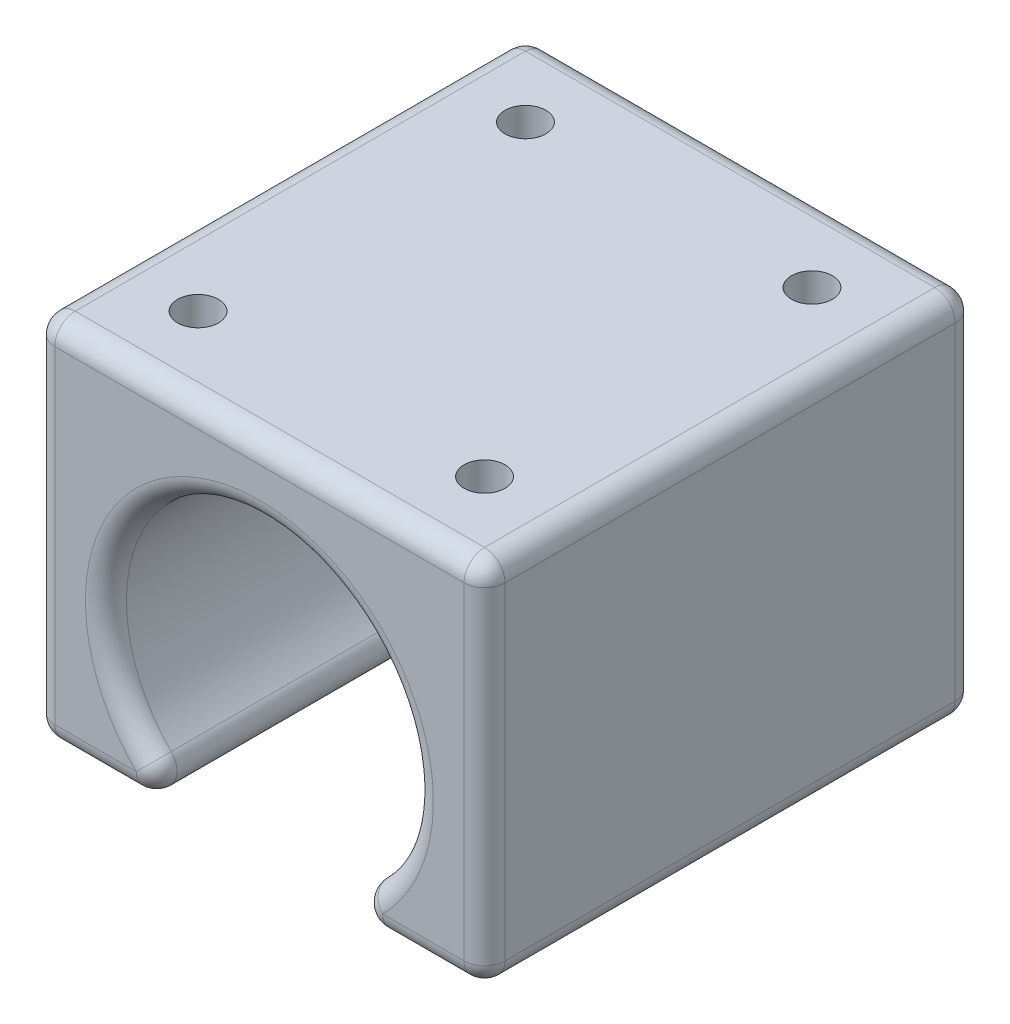
ISO-10303-21;
HEADER;
FILE_DESCRIPTION(('STEP AP214'),'2;1');
FILE_NAME('part.step','',(''),(''),'','','');
FILE_SCHEMA(('AUTOMOTIVE_DESIGN { 1 0 10303 214 1 1 1 1 }'));
ENDSEC;
DATA;
#1=APPLICATION_CONTEXT('core data for automotive mechanical design processes');
#2=APPLICATION_PROTOCOL_DEFINITION('international standard','automotive_design',2000,#1);
#3=PRODUCT_CONTEXT('',#1,'mechanical');
#4=PRODUCT('Part','Part','',(#3));
#5=PRODUCT_RELATED_PRODUCT_CATEGORY('part','',(#4));
#6=PRODUCT_DEFINITION_FORMATION('','',#4);
#7=PRODUCT_DEFINITION_CONTEXT('part definition',#1,'design');
#8=PRODUCT_DEFINITION('design','',#6,#7);
#9=PRODUCT_DEFINITION_SHAPE('','',#8);
#10=(LENGTH_UNIT() NAMED_UNIT(*) SI_UNIT(.MILLI.,.METRE.));
#11=(NAMED_UNIT(*) PLANE_ANGLE_UNIT() SI_UNIT($,.RADIAN.));
#12=(NAMED_UNIT(*) SI_UNIT($,.STERADIAN.) SOLID_ANGLE_UNIT());
#13=UNCERTAINTY_MEASURE_WITH_UNIT(LENGTH_MEASURE(1.E-05),#10,'distance_accuracy_value','');
#14=(GEOMETRIC_REPRESENTATION_CONTEXT(3) GLOBAL_UNCERTAINTY_ASSIGNED_CONTEXT((#13)) GLOBAL_UNIT_ASSIGNED_CONTEXT((#10,
#11,#12)) REPRESENTATION_CONTEXT('',''));
#15=CARTESIAN_POINT('',(0.,0.,0.));
#16=DIRECTION('',(0.,0.,1.));
#17=DIRECTION('',(1.,0.,0.));
#18=AXIS2_PLACEMENT_3D('',#15,#16,#17);
#19=CARTESIAN_POINT('',(-11.,-8.99999999999999,-12.));
#20=DIRECTION('',(-1.,0.,0.));
#21=DIRECTION('',(0.,0.,1.));
#22=AXIS2_PLACEMENT_3D('',#19,#20,#21);
#23=PLANE('',#22);
#24=DIRECTION('',(0.,0.,1.));
#25=VECTOR('',#24,1.);
#26=CARTESIAN_POINT('',(-11.,8.,-12.));
#27=LINE('',#26,#25);
#28=CARTESIAN_POINT('',(-11.,8.,11.));
#29=VERTEX_POINT('',#28);
#30=CARTESIAN_POINT('',(-11.,8.,-11.));
#31=VERTEX_POINT('',#30);
#32=EDGE_CURVE('E172',#29,#31,#27,.F.);
#33=ORIENTED_EDGE('',*,*,#32,.T.);
#34=DIRECTION('',(0.,-1.,0.));
#35=VECTOR('',#34,1.);
#36=CARTESIAN_POINT('',(-11.,-8.99999999999999,-11.));
#37=LINE('',#36,#35);
#38=CARTESIAN_POINT('',(-11.,-7.99999999999999,-11.));
#39=VERTEX_POINT('',#38);
#40=EDGE_CURVE('E211',#31,#39,#37,.T.);
#41=ORIENTED_EDGE('',*,*,#40,.T.);
#42=DIRECTION('',(0.,0.,1.));
#43=VECTOR('',#42,1.);
#44=CARTESIAN_POINT('',(-11.,-7.99999999999999,-12.));
#45=LINE('',#44,#43);
#46=CARTESIAN_POINT('',(-11.,-7.99999999999999,11.));
#47=VERTEX_POINT('',#46);
#48=EDGE_CURVE('E204',#39,#47,#45,.T.);
#49=ORIENTED_EDGE('',*,*,#48,.T.);
#50=DIRECTION('',(0.,-1.,0.));
#51=VECTOR('',#50,1.);
#52=CARTESIAN_POINT('',(-11.,-8.99999999999999,11.));
#53=LINE('',#52,#51);
#54=EDGE_CURVE('E202',#47,#29,#53,.F.);
#55=ORIENTED_EDGE('',*,*,#54,.T.);
#56=EDGE_LOOP('',(#33,#41,#49,#55));
#57=FACE_BOUND('',#56,.T.);
#58=ADVANCED_FACE('F40',(#57),#23,.T.);
#59=CARTESIAN_POINT('',(11.,9.,-12.));
#60=DIRECTION('',(0.,1.,0.));
#61=DIRECTION('',(0.,0.,1.));
#62=AXIS2_PLACEMENT_3D('',#59,#60,#61);
#63=PLANE('',#62);
#64=DIRECTION('',(-1.,0.,0.));
#65=VECTOR('',#64,1.);
#66=CARTESIAN_POINT('',(-11.,9.,-11.));
#67=LINE('',#66,#65);
#68=CARTESIAN_POINT('',(9.99999999999999,9.,-11.));
#69=VERTEX_POINT('',#68);
#70=CARTESIAN_POINT('',(-10.,9.,-11.));
#71=VERTEX_POINT('',#70);
#72=EDGE_CURVE('E200',#69,#71,#67,.T.);
#73=ORIENTED_EDGE('',*,*,#72,.T.);
#74=DIRECTION('',(0.,0.,1.));
#75=VECTOR('',#74,1.);
#76=CARTESIAN_POINT('',(-10.,9.,-12.));
#77=LINE('',#76,#75);
#78=CARTESIAN_POINT('',(-10.,9.,11.));
#79=VERTEX_POINT('',#78);
#80=EDGE_CURVE('E170',#71,#79,#77,.T.);
#81=ORIENTED_EDGE('',*,*,#80,.T.);
#82=DIRECTION('',(-1.,0.,0.));
#83=VECTOR('',#82,1.);
#84=CARTESIAN_POINT('',(11.,9.,11.));
#85=LINE('',#84,#83);
#86=CARTESIAN_POINT('',(9.99999999999999,9.,11.));
#87=VERTEX_POINT('',#86);
#88=EDGE_CURVE('E188',#79,#87,#85,.F.);
#89=ORIENTED_EDGE('',*,*,#88,.T.);
#90=DIRECTION('',(0.,0.,1.));
#91=VECTOR('',#90,1.);
#92=CARTESIAN_POINT('',(9.99999999999999,9.,-12.));
#93=LINE('',#92,#91);
#94=EDGE_CURVE('E194',#87,#69,#93,.F.);
#95=ORIENTED_EDGE('',*,*,#94,.T.);
#96=EDGE_LOOP('',(#73,#81,#89,#95));
#97=FACE_BOUND('',#96,.T.);
#98=CARTESIAN_POINT('',(-7.,9.,8.));
#99=DIRECTION('',(0.,1.,0.));
#100=DIRECTION('',(0.,0.,1.));
#101=AXIS2_PLACEMENT_3D('',#98,#99,#100);
#102=CIRCLE('',#101,1.);
#103=CARTESIAN_POINT('',(-7.,9.,9.));
#104=VERTEX_POINT('',#103);
#105=EDGE_CURVE('E368',#104,#104,#102,.T.);
#106=ORIENTED_EDGE('',*,*,#105,.F.);
#107=EDGE_LOOP('',(#106));
#108=FACE_BOUND('',#107,.T.);
#109=CARTESIAN_POINT('',(7.,9.,8.));
#110=DIRECTION('',(0.,1.,0.));
#111=DIRECTION('',(0.,0.,1.));
#112=AXIS2_PLACEMENT_3D('',#109,#110,#111);
#113=CIRCLE('',#112,1.);
#114=CARTESIAN_POINT('',(7.,9.,9.));
#115=VERTEX_POINT('',#114);
#116=EDGE_CURVE('E986',#115,#115,#113,.T.);
#117=ORIENTED_EDGE('',*,*,#116,.F.);
#118=EDGE_LOOP('',(#117));
#119=FACE_BOUND('',#118,.T.);
#120=CARTESIAN_POINT('',(7.,9.,-8.));
#121=DIRECTION('',(0.,1.,0.));
#122=DIRECTION('',(0.,0.,1.));
#123=AXIS2_PLACEMENT_3D('',#120,#121,#122);
#124=CIRCLE('',#123,1.);
#125=CARTESIAN_POINT('',(7.,9.,-7.));
#126=VERTEX_POINT('',#125);
#127=EDGE_CURVE('E381',#126,#126,#124,.T.);
#128=ORIENTED_EDGE('',*,*,#127,.F.);
#129=EDGE_LOOP('',(#128));
#130=FACE_BOUND('',#129,.T.);
#131=CARTESIAN_POINT('',(-7.,9.,-8.));
#132=DIRECTION('',(0.,1.,0.));
#133=DIRECTION('',(0.,0.,1.));
#134=AXIS2_PLACEMENT_3D('',#131,#132,#133);
#135=CIRCLE('',#134,1.);
#136=CARTESIAN_POINT('',(-7.,9.,-7.));
#137=VERTEX_POINT('',#136);
#138=EDGE_CURVE('E379',#137,#137,#135,.T.);
#139=ORIENTED_EDGE('',*,*,#138,.F.);
#140=EDGE_LOOP('',(#139));
#141=FACE_BOUND('',#140,.T.);
#142=ADVANCED_FACE('F197',(#97,#108,#119,#130,#141),#63,.T.);
#143=CARTESIAN_POINT('',(11.,-8.99999999999999,-12.));
#144=DIRECTION('',(1.,0.,0.));
#145=DIRECTION('',(0.,0.,-1.));
#146=AXIS2_PLACEMENT_3D('',#143,#144,#145);
#147=PLANE('',#146);
#148=DIRECTION('',(0.,0.,1.));
#149=VECTOR('',#148,1.);
#150=CARTESIAN_POINT('',(11.,-7.99999999999999,-12.));
#151=LINE('',#150,#149);
#152=CARTESIAN_POINT('',(11.,-7.99999999999999,11.));
#153=VERTEX_POINT('',#152);
#154=CARTESIAN_POINT('',(11.,-7.99999999999999,-11.));
#155=VERTEX_POINT('',#154);
#156=EDGE_CURVE('E257',#153,#155,#151,.F.);
#157=ORIENTED_EDGE('',*,*,#156,.T.);
#158=DIRECTION('',(0.,1.,0.));
#159=VECTOR('',#158,1.);
#160=CARTESIAN_POINT('',(11.,9.,-11.));
#161=LINE('',#160,#159);
#162=CARTESIAN_POINT('',(11.,8.,-11.));
#163=VERTEX_POINT('',#162);
#164=EDGE_CURVE('E259',#155,#163,#161,.T.);
#165=ORIENTED_EDGE('',*,*,#164,.T.);
#166=DIRECTION('',(0.,0.,1.));
#167=VECTOR('',#166,1.);
#168=CARTESIAN_POINT('',(11.,8.,-12.));
#169=LINE('',#168,#167);
#170=CARTESIAN_POINT('',(11.,8.,11.));
#171=VERTEX_POINT('',#170);
#172=EDGE_CURVE('E255',#163,#171,#169,.T.);
#173=ORIENTED_EDGE('',*,*,#172,.T.);
#174=DIRECTION('',(0.,1.,0.));
#175=VECTOR('',#174,1.);
#176=CARTESIAN_POINT('',(11.,-8.99999999999999,11.));
#177=LINE('',#176,#175);
#178=EDGE_CURVE('E253',#171,#153,#177,.F.);
#179=ORIENTED_EDGE('',*,*,#178,.T.);
#180=EDGE_LOOP('',(#157,#165,#173,#179));
#181=FACE_BOUND('',#180,.T.);
#182=ADVANCED_FACE('F430',(#181),#147,.T.);
#183=CARTESIAN_POINT('',(11.,-8.99999999999999,-12.));
#184=DIRECTION('',(0.,-1.,0.));
#185=DIRECTION('',(1.,0.,0.));
#186=AXIS2_PLACEMENT_3D('',#183,#184,#185);
#187=PLANE('',#186);
#188=DIRECTION('',(0.,0.,1.));
#189=VECTOR('',#188,1.);
#190=CARTESIAN_POINT('',(6.02079728939616,-8.99999999999999,-12.));
#191=LINE('',#190,#189);
#192=CARTESIAN_POINT('',(6.02079728939616,-8.99999999999999,11.));
#193=VERTEX_POINT('',#192);
#194=CARTESIAN_POINT('',(6.02079728939616,-8.99999999999999,-11.));
#195=VERTEX_POINT('',#194);
#196=EDGE_CURVE('E244',#193,#195,#191,.F.);
#197=ORIENTED_EDGE('',*,*,#196,.T.);
#198=DIRECTION('',(1.,0.,0.));
#199=VECTOR('',#198,1.);
#200=CARTESIAN_POINT('',(11.,-8.99999999999999,-11.));
#201=LINE('',#200,#199);
#202=CARTESIAN_POINT('',(9.99999999999999,-8.99999999999999,-11.));
#203=VERTEX_POINT('',#202);
#204=EDGE_CURVE('E250',#195,#203,#201,.T.);
#205=ORIENTED_EDGE('',*,*,#204,.T.);
#206=DIRECTION('',(0.,0.,1.));
#207=VECTOR('',#206,1.);
#208=CARTESIAN_POINT('',(9.99999999999999,-8.99999999999999,-12.));
#209=LINE('',#208,#207);
#210=CARTESIAN_POINT('',(9.99999999999999,-8.99999999999999,11.));
#211=VERTEX_POINT('',#210);
#212=EDGE_CURVE('E248',#203,#211,#209,.T.);
#213=ORIENTED_EDGE('',*,*,#212,.T.);
#214=DIRECTION('',(1.,0.,0.));
#215=VECTOR('',#214,1.);
#216=CARTESIAN_POINT('',(11.,-8.99999999999999,11.));
#217=LINE('',#216,#215);
#218=EDGE_CURVE('E246',#211,#193,#217,.F.);
#219=ORIENTED_EDGE('',*,*,#218,.T.);
#220=EDGE_LOOP('',(#197,#205,#213,#219));
#221=FACE_BOUND('',#220,.T.);
#222=ADVANCED_FACE('F540',(#221),#187,.T.);
#223=CARTESIAN_POINT('',(0.,-2.,-12.));
#224=DIRECTION('',(0.,0.,1.));
#225=DIRECTION('',(1.,0.,0.));
#226=AXIS2_PLACEMENT_3D('',#223,#224,#225);
#227=CYLINDRICAL_SURFACE('',#226,7.5);
#228=CARTESIAN_POINT('',(0.,-2.,-11.));
#229=DIRECTION('',(0.,0.,1.));
#230=DIRECTION('',(1.,0.,0.));
#231=AXIS2_PLACEMENT_3D('',#228,#229,#230);
#232=CIRCLE('',#231,7.5);
#233=CARTESIAN_POINT('',(-5.31246819652601,-7.29411764705882,-11.));
#234=VERTEX_POINT('',#233);
#235=CARTESIAN_POINT('',(5.31246819652602,-7.29411764705882,-11.));
#236=VERTEX_POINT('',#235);
#237=EDGE_CURVE('E239',#234,#236,#232,.F.);
#238=ORIENTED_EDGE('',*,*,#237,.T.);
#239=DIRECTION('',(0.,0.,1.));
#240=VECTOR('',#239,1.);
#241=CARTESIAN_POINT('',(5.31246819652602,-7.29411764705882,-12.));
#242=LINE('',#241,#240);
#243=CARTESIAN_POINT('',(5.31246819652602,-7.29411764705882,11.));
#244=VERTEX_POINT('',#243);
#245=EDGE_CURVE('E242',#236,#244,#242,.T.);
#246=ORIENTED_EDGE('',*,*,#245,.T.);
#247=CARTESIAN_POINT('',(0.,-2.,11.));
#248=DIRECTION('',(0.,0.,1.));
#249=DIRECTION('',(1.,0.,0.));
#250=AXIS2_PLACEMENT_3D('',#247,#248,#249);
#251=CIRCLE('',#250,7.5);
#252=CARTESIAN_POINT('',(-5.31246819652601,-7.29411764705882,11.));
#253=VERTEX_POINT('',#252);
#254=EDGE_CURVE('E237',#244,#253,#251,.T.);
#255=ORIENTED_EDGE('',*,*,#254,.T.);
#256=DIRECTION('',(0.,0.,1.));
#257=VECTOR('',#256,1.);
#258=CARTESIAN_POINT('',(-5.31246819652601,-7.29411764705882,-12.));
#259=LINE('',#258,#257);
#260=EDGE_CURVE('E235',#253,#234,#259,.F.);
#261=ORIENTED_EDGE('',*,*,#260,.T.);
#262=EDGE_LOOP('',(#238,#246,#255,#261));
#263=FACE_BOUND('',#262,.T.);
#264=ADVANCED_FACE('F545',(#263),#227,.F.);
#265=CARTESIAN_POINT('',(-2.69258240356727,-9.,-12.));
#266=DIRECTION('',(0.,-1.,0.));
#267=DIRECTION('',(1.,0.,0.));
#268=AXIS2_PLACEMENT_3D('',#265,#266,#267);
#269=PLANE('',#268);
#270=DIRECTION('',(1.,0.,0.));
#271=VECTOR('',#270,1.);
#272=CARTESIAN_POINT('',(-2.69258240356727,-9.,11.));
#273=LINE('',#272,#271);
#274=CARTESIAN_POINT('',(-6.02079728939615,-9.,11.));
#275=VERTEX_POINT('',#274);
#276=CARTESIAN_POINT('',(-10.,-8.99999999999999,11.));
#277=VERTEX_POINT('',#276);
#278=EDGE_CURVE('E215',#275,#277,#273,.F.);
#279=ORIENTED_EDGE('',*,*,#278,.T.);
#280=DIRECTION('',(0.,0.,1.));
#281=VECTOR('',#280,1.);
#282=CARTESIAN_POINT('',(-10.,-8.99999999999999,-12.));
#283=LINE('',#282,#281);
#284=CARTESIAN_POINT('',(-10.,-8.99999999999999,-11.));
#285=VERTEX_POINT('',#284);
#286=EDGE_CURVE('E219',#277,#285,#283,.F.);
#287=ORIENTED_EDGE('',*,*,#286,.T.);
#288=DIRECTION('',(1.,0.,0.));
#289=VECTOR('',#288,1.);
#290=CARTESIAN_POINT('',(-2.69258240356727,-9.,-11.));
#291=LINE('',#290,#289);
#292=CARTESIAN_POINT('',(-6.02079728939615,-9.,-11.));
#293=VERTEX_POINT('',#292);
#294=EDGE_CURVE('E217',#285,#293,#291,.T.);
#295=ORIENTED_EDGE('',*,*,#294,.T.);
#296=DIRECTION('',(0.,0.,1.));
#297=VECTOR('',#296,1.);
#298=CARTESIAN_POINT('',(-6.02079728939615,-9.,-12.));
#299=LINE('',#298,#297);
#300=EDGE_CURVE('E213',#293,#275,#299,.T.);
#301=ORIENTED_EDGE('',*,*,#300,.T.);
#302=EDGE_LOOP('',(#279,#287,#295,#301));
#303=FACE_BOUND('',#302,.T.);
#304=ADVANCED_FACE('F422',(#303),#269,.T.);
#305=CARTESIAN_POINT('',(0.,-2.,-12.));
#306=DIRECTION('',(0.,0.,1.));
#307=DIRECTION('',(1.,0.,0.));
#308=AXIS2_PLACEMENT_3D('',#305,#306,#307);
#309=PLANE('',#308);
#310=DIRECTION('',(1.,0.,0.));
#311=VECTOR('',#310,1.);
#312=CARTESIAN_POINT('',(-11.,-7.99999999999999,-12.));
#313=LINE('',#312,#311);
#314=CARTESIAN_POINT('',(-6.02079728939615,-8.,-12.));
#315=VERTEX_POINT('',#314);
#316=CARTESIAN_POINT('',(-10.,-7.99999999999999,-12.));
#317=VERTEX_POINT('',#316);
#318=EDGE_CURVE('E230',#315,#317,#313,.F.);
#319=ORIENTED_EDGE('',*,*,#318,.T.);
#320=DIRECTION('',(0.,-1.,0.));
#321=VECTOR('',#320,1.);
#322=CARTESIAN_POINT('',(-10.,9.,-12.));
#323=LINE('',#322,#321);
#324=CARTESIAN_POINT('',(-10.,8.,-12.));
#325=VERTEX_POINT('',#324);
#326=EDGE_CURVE('E233',#317,#325,#323,.F.);
#327=ORIENTED_EDGE('',*,*,#326,.T.);
#328=DIRECTION('',(-1.,0.,0.));
#329=VECTOR('',#328,1.);
#330=CARTESIAN_POINT('',(11.,8.,-12.));
#331=LINE('',#330,#329);
#332=CARTESIAN_POINT('',(9.99999999999999,8.,-12.));
#333=VERTEX_POINT('',#332);
#334=EDGE_CURVE('E224',#325,#333,#331,.F.);
#335=ORIENTED_EDGE('',*,*,#334,.T.);
#336=DIRECTION('',(0.,1.,0.));
#337=VECTOR('',#336,1.);
#338=CARTESIAN_POINT('',(9.99999999999999,-8.99999999999999,-12.));
#339=LINE('',#338,#337);
#340=CARTESIAN_POINT('',(9.99999999999999,-7.99999999999999,-12.));
#341=VERTEX_POINT('',#340);
#342=EDGE_CURVE('E222',#333,#341,#339,.F.);
#343=ORIENTED_EDGE('',*,*,#342,.T.);
#344=DIRECTION('',(1.,0.,0.));
#345=VECTOR('',#344,1.);
#346=CARTESIAN_POINT('',(2.69258240356727,-7.99999999999999,-12.));
#347=LINE('',#346,#345);
#348=CARTESIAN_POINT('',(6.02079728939616,-7.99999999999999,-12.));
#349=VERTEX_POINT('',#348);
#350=EDGE_CURVE('E226',#341,#349,#347,.F.);
#351=ORIENTED_EDGE('',*,*,#350,.T.);
#352=CARTESIAN_POINT('',(0.,-2.,-12.));
#353=DIRECTION('',(0.,0.,1.));
#354=DIRECTION('',(1.,0.,0.));
#355=AXIS2_PLACEMENT_3D('',#352,#353,#354);
#356=CIRCLE('',#355,8.5);
#357=EDGE_CURVE('E228',#349,#315,#356,.T.);
#358=ORIENTED_EDGE('',*,*,#357,.T.);
#359=EDGE_LOOP('',(#319,#327,#335,#343,#351,#358));
#360=FACE_BOUND('',#359,.T.);
#361=ADVANCED_FACE('F413',(#360),#309,.F.);
#362=CARTESIAN_POINT('',(0.,-2.,12.));
#363=DIRECTION('',(0.,0.,1.));
#364=DIRECTION('',(1.,0.,0.));
#365=AXIS2_PLACEMENT_3D('',#362,#363,#364);
#366=PLANE('',#365);
#367=DIRECTION('',(0.,1.,0.));
#368=VECTOR('',#367,1.);
#369=CARTESIAN_POINT('',(9.99999999999999,-2.,12.));
#370=LINE('',#369,#368);
#371=CARTESIAN_POINT('',(9.99999999999999,-7.99999999999999,12.));
#372=VERTEX_POINT('',#371);
#373=CARTESIAN_POINT('',(9.99999999999999,8.,12.));
#374=VERTEX_POINT('',#373);
#375=EDGE_CURVE('E49',#372,#374,#370,.T.);
#376=ORIENTED_EDGE('',*,*,#375,.T.);
#377=DIRECTION('',(-1.,0.,0.));
#378=VECTOR('',#377,1.);
#379=CARTESIAN_POINT('',(0.,8.,12.));
#380=LINE('',#379,#378);
#381=CARTESIAN_POINT('',(-10.,8.,12.));
#382=VERTEX_POINT('',#381);
#383=EDGE_CURVE('E11',#374,#382,#380,.T.);
#384=ORIENTED_EDGE('',*,*,#383,.T.);
#385=DIRECTION('',(0.,-1.,0.));
#386=VECTOR('',#385,1.);
#387=CARTESIAN_POINT('',(-10.,-2.,12.));
#388=LINE('',#387,#386);
#389=CARTESIAN_POINT('',(-10.,-8.,12.));
#390=VERTEX_POINT('',#389);
#391=EDGE_CURVE('E262',#382,#390,#388,.T.);
#392=ORIENTED_EDGE('',*,*,#391,.T.);
#393=DIRECTION('',(1.,0.,0.));
#394=VECTOR('',#393,1.);
#395=CARTESIAN_POINT('',(0.,-8.,12.));
#396=LINE('',#395,#394);
#397=CARTESIAN_POINT('',(-6.02079728939615,-8.,12.));
#398=VERTEX_POINT('',#397);
#399=EDGE_CURVE('E264',#390,#398,#396,.T.);
#400=ORIENTED_EDGE('',*,*,#399,.T.);
#401=CARTESIAN_POINT('',(0.,-2.,12.));
#402=DIRECTION('',(0.,0.,1.));
#403=DIRECTION('',(1.,0.,0.));
#404=AXIS2_PLACEMENT_3D('',#401,#402,#403);
#405=CIRCLE('',#404,8.5);
#406=CARTESIAN_POINT('',(6.02079728939616,-7.99999999999999,12.));
#407=VERTEX_POINT('',#406);
#408=EDGE_CURVE('E266',#398,#407,#405,.F.);
#409=ORIENTED_EDGE('',*,*,#408,.T.);
#410=DIRECTION('',(1.,0.,0.));
#411=VECTOR('',#410,1.);
#412=CARTESIAN_POINT('',(0.,-7.99999999999999,12.));
#413=LINE('',#412,#411);
#414=EDGE_CURVE('E60',#407,#372,#413,.T.);
#415=ORIENTED_EDGE('',*,*,#414,.T.);
#416=EDGE_LOOP('',(#376,#384,#392,#400,#409,#415));
#417=FACE_BOUND('',#416,.T.);
#418=ADVANCED_FACE('F410',(#417),#366,.T.);
#419=CARTESIAN_POINT('',(-7.,5.,-8.));
#420=DIRECTION('',(0.,1.,0.));
#421=DIRECTION('',(0.,0.,1.));
#422=AXIS2_PLACEMENT_3D('',#419,#420,#421);
#423=CYLINDRICAL_SURFACE('',#422,1.);
#424=CARTESIAN_POINT('',(-7.,5.,-8.));
#425=DIRECTION('',(0.,1.,0.));
#426=DIRECTION('',(0.,0.,1.));
#427=AXIS2_PLACEMENT_3D('',#424,#425,#426);
#428=CIRCLE('',#427,1.);
#429=CARTESIAN_POINT('',(-7.,5.,-7.));
#430=VERTEX_POINT('',#429);
#431=EDGE_CURVE('E195',#430,#430,#428,.T.);
#432=ORIENTED_EDGE('',*,*,#431,.F.);
#433=EDGE_LOOP('',(#432));
#434=FACE_BOUND('',#433,.T.);
#435=ORIENTED_EDGE('',*,*,#138,.T.);
#436=EDGE_LOOP('',(#435));
#437=FACE_BOUND('',#436,.T.);
#438=ADVANCED_FACE('F412',(#434,#437),#423,.F.);
#439=CARTESIAN_POINT('',(-7.,5.,-8.));
#440=DIRECTION('',(0.,1.,0.));
#441=DIRECTION('',(0.,0.,1.));
#442=AXIS2_PLACEMENT_3D('',#439,#440,#441);
#443=PLANE('',#442);
#444=ORIENTED_EDGE('',*,*,#431,.T.);
#445=EDGE_LOOP('',(#444));
#446=FACE_BOUND('',#445,.T.);
#447=ADVANCED_FACE('F419',(#446),#443,.T.);
#448=CARTESIAN_POINT('',(7.,5.,-8.));
#449=DIRECTION('',(0.,1.,0.));
#450=DIRECTION('',(0.,0.,1.));
#451=AXIS2_PLACEMENT_3D('',#448,#449,#450);
#452=CYLINDRICAL_SURFACE('',#451,1.);
#453=CARTESIAN_POINT('',(7.,5.,-8.));
#454=DIRECTION('',(0.,1.,0.));
#455=DIRECTION('',(0.,0.,1.));
#456=AXIS2_PLACEMENT_3D('',#453,#454,#455);
#457=CIRCLE('',#456,1.);
#458=CARTESIAN_POINT('',(7.,5.,-7.));
#459=VERTEX_POINT('',#458);
#460=EDGE_CURVE('E981',#459,#459,#457,.T.);
#461=ORIENTED_EDGE('',*,*,#460,.F.);
#462=EDGE_LOOP('',(#461));
#463=FACE_BOUND('',#462,.T.);
#464=ORIENTED_EDGE('',*,*,#127,.T.);
#465=EDGE_LOOP('',(#464));
#466=FACE_BOUND('',#465,.T.);
#467=ADVANCED_FACE('F909',(#463,#466),#452,.F.);
#468=CARTESIAN_POINT('',(7.,5.,-8.));
#469=DIRECTION('',(0.,1.,0.));
#470=DIRECTION('',(0.,0.,1.));
#471=AXIS2_PLACEMENT_3D('',#468,#469,#470);
#472=PLANE('',#471);
#473=ORIENTED_EDGE('',*,*,#460,.T.);
#474=EDGE_LOOP('',(#473));
#475=FACE_BOUND('',#474,.T.);
#476=ADVANCED_FACE('F899',(#475),#472,.T.);
#477=CARTESIAN_POINT('',(7.,5.,8.));
#478=DIRECTION('',(0.,1.,0.));
#479=DIRECTION('',(0.,0.,1.));
#480=AXIS2_PLACEMENT_3D('',#477,#478,#479);
#481=CYLINDRICAL_SURFACE('',#480,1.);
#482=CARTESIAN_POINT('',(7.,5.,8.));
#483=DIRECTION('',(0.,1.,0.));
#484=DIRECTION('',(0.,0.,1.));
#485=AXIS2_PLACEMENT_3D('',#482,#483,#484);
#486=CIRCLE('',#485,1.);
#487=CARTESIAN_POINT('',(7.,5.,9.));
#488=VERTEX_POINT('',#487);
#489=EDGE_CURVE('E373',#488,#488,#486,.T.);
#490=ORIENTED_EDGE('',*,*,#489,.F.);
#491=EDGE_LOOP('',(#490));
#492=FACE_BOUND('',#491,.T.);
#493=ORIENTED_EDGE('',*,*,#116,.T.);
#494=EDGE_LOOP('',(#493));
#495=FACE_BOUND('',#494,.T.);
#496=ADVANCED_FACE('F889',(#492,#495),#481,.F.);
#497=CARTESIAN_POINT('',(7.,5.,8.));
#498=DIRECTION('',(0.,1.,0.));
#499=DIRECTION('',(0.,0.,1.));
#500=AXIS2_PLACEMENT_3D('',#497,#498,#499);
#501=PLANE('',#500);
#502=ORIENTED_EDGE('',*,*,#489,.T.);
#503=EDGE_LOOP('',(#502));
#504=FACE_BOUND('',#503,.T.);
#505=ADVANCED_FACE('F879',(#504),#501,.T.);
#506=CARTESIAN_POINT('',(-7.,5.,8.));
#507=DIRECTION('',(0.,1.,0.));
#508=DIRECTION('',(0.,0.,1.));
#509=AXIS2_PLACEMENT_3D('',#506,#507,#508);
#510=CYLINDRICAL_SURFACE('',#509,1.);
#511=CARTESIAN_POINT('',(-7.,5.,8.));
#512=DIRECTION('',(0.,1.,0.));
#513=DIRECTION('',(0.,0.,1.));
#514=AXIS2_PLACEMENT_3D('',#511,#512,#513);
#515=CIRCLE('',#514,1.);
#516=CARTESIAN_POINT('',(-7.,5.,9.));
#517=VERTEX_POINT('',#516);
#518=EDGE_CURVE('E361',#517,#517,#515,.T.);
#519=ORIENTED_EDGE('',*,*,#518,.F.);
#520=EDGE_LOOP('',(#519));
#521=FACE_BOUND('',#520,.T.);
#522=ORIENTED_EDGE('',*,*,#105,.T.);
#523=EDGE_LOOP('',(#522));
#524=FACE_BOUND('',#523,.T.);
#525=ADVANCED_FACE('F870',(#521,#524),#510,.F.);
#526=CARTESIAN_POINT('',(-7.,5.,8.));
#527=DIRECTION('',(0.,1.,0.));
#528=DIRECTION('',(0.,0.,1.));
#529=AXIS2_PLACEMENT_3D('',#526,#527,#528);
#530=PLANE('',#529);
#531=ORIENTED_EDGE('',*,*,#518,.T.);
#532=EDGE_LOOP('',(#531));
#533=FACE_BOUND('',#532,.T.);
#534=ADVANCED_FACE('F532',(#533),#530,.T.);
#535=CARTESIAN_POINT('',(6.02079728939616,-7.99999999999999,-12.));
#536=DIRECTION('',(0.,0.,1.));
#537=DIRECTION('',(1.,0.,0.));
#538=AXIS2_PLACEMENT_3D('',#535,#536,#537);
#539=CYLINDRICAL_SURFACE('',#538,1.);
#540=CARTESIAN_POINT('',(6.02079728939616,-7.99999999999999,-11.));
#541=DIRECTION('',(0.,0.,-1.));
#542=DIRECTION('',(-1.,0.,0.));
#543=AXIS2_PLACEMENT_3D('',#540,#541,#542);
#544=CIRCLE('',#543,1.);
#545=EDGE_CURVE('E44',#195,#236,#544,.T.);
#546=ORIENTED_EDGE('',*,*,#545,.F.);
#547=ORIENTED_EDGE('',*,*,#196,.F.);
#548=CARTESIAN_POINT('',(6.02079728939616,-7.99999999999999,11.));
#549=DIRECTION('',(0.,0.,1.));
#550=DIRECTION('',(1.,0.,0.));
#551=AXIS2_PLACEMENT_3D('',#548,#549,#550);
#552=CIRCLE('',#551,1.);
#553=EDGE_CURVE('E354',#244,#193,#552,.T.);
#554=ORIENTED_EDGE('',*,*,#553,.F.);
#555=ORIENTED_EDGE('',*,*,#245,.F.);
#556=EDGE_LOOP('',(#546,#547,#554,#555));
#557=FACE_BOUND('',#556,.T.);
#558=ADVANCED_FACE('F42',(#557),#539,.T.);
#559=CARTESIAN_POINT('',(6.02079728939616,-7.99999999999999,-11.));
#560=DIRECTION('',(0.,0.,-1.));
#561=DIRECTION('',(0.,1.,0.));
#562=AXIS2_PLACEMENT_3D('',#559,#560,#561);
#563=SPHERICAL_SURFACE('',#562,1.);
#564=CARTESIAN_POINT('',(6.02079728939616,-7.99999999999999,-11.));
#565=DIRECTION('',(-1.,0.,0.));
#566=DIRECTION('',(0.,0.,1.));
#567=AXIS2_PLACEMENT_3D('',#564,#565,#566);
#568=CIRCLE('',#567,1.);
#569=EDGE_CURVE('E350',#195,#349,#568,.F.);
#570=ORIENTED_EDGE('',*,*,#569,.F.);
#571=ORIENTED_EDGE('',*,*,#545,.T.);
#572=CARTESIAN_POINT('',(6.02079728939616,-7.99999999999999,-11.));
#573=DIRECTION('',(-0.705882352941175,-0.708329092870136,0.));
#574=DIRECTION('',(0.708329092870136,-0.705882352941175,0.));
#575=AXIS2_PLACEMENT_3D('',#572,#573,#574);
#576=CIRCLE('',#575,1.);
#577=EDGE_CURVE('E353',#349,#236,#576,.F.);
#578=ORIENTED_EDGE('',*,*,#577,.F.);
#579=EDGE_LOOP('',(#570,#571,#578));
#580=FACE_BOUND('',#579,.T.);
#581=ADVANCED_FACE('F527',(#580),#563,.T.);
#582=CARTESIAN_POINT('',(6.02079728939616,-7.99999999999999,11.));
#583=DIRECTION('',(0.,0.,1.));
#584=DIRECTION('',(1.,0.,0.));
#585=AXIS2_PLACEMENT_3D('',#582,#583,#584);
#586=SPHERICAL_SURFACE('',#585,1.);
#587=CARTESIAN_POINT('',(6.02079728939616,-7.99999999999999,11.));
#588=DIRECTION('',(-0.705882352941175,-0.708329092870137,0.));
#589=DIRECTION('',(0.708329092870137,-0.705882352941175,0.));
#590=AXIS2_PLACEMENT_3D('',#587,#588,#589);
#591=CIRCLE('',#590,1.);
#592=EDGE_CURVE('E344',#244,#407,#591,.F.);
#593=ORIENTED_EDGE('',*,*,#592,.F.);
#594=ORIENTED_EDGE('',*,*,#553,.T.);
#595=CARTESIAN_POINT('',(6.02079728939616,-7.99999999999999,11.));
#596=DIRECTION('',(-1.,0.,0.));
#597=DIRECTION('',(0.,0.,1.));
#598=AXIS2_PLACEMENT_3D('',#595,#596,#597);
#599=CIRCLE('',#598,1.);
#600=EDGE_CURVE('E347',#407,#193,#599,.F.);
#601=ORIENTED_EDGE('',*,*,#600,.F.);
#602=EDGE_LOOP('',(#593,#594,#601));
#603=FACE_BOUND('',#602,.T.);
#604=ADVANCED_FACE('F524',(#603),#586,.T.);
#605=CARTESIAN_POINT('',(0.,-2.,-11.));
#606=DIRECTION('',(0.,0.,1.));
#607=DIRECTION('',(1.,0.,0.));
#608=AXIS2_PLACEMENT_3D('',#605,#606,#607);
#609=TOROIDAL_SURFACE('',#608,8.5,1.);
#610=ORIENTED_EDGE('',*,*,#577,.T.);
#611=ORIENTED_EDGE('',*,*,#237,.F.);
#612=CARTESIAN_POINT('',(-6.02079728939615,-8.,-11.));
#613=DIRECTION('',(0.705882352941175,-0.708329092870136,0.));
#614=DIRECTION('',(0.708329092870136,0.705882352941175,0.));
#615=AXIS2_PLACEMENT_3D('',#612,#613,#614);
#616=CIRCLE('',#615,1.);
#617=EDGE_CURVE('E338',#315,#234,#616,.T.);
#618=ORIENTED_EDGE('',*,*,#617,.F.);
#619=ORIENTED_EDGE('',*,*,#357,.F.);
#620=EDGE_LOOP('',(#610,#611,#618,#619));
#621=FACE_BOUND('',#620,.T.);
#622=ADVANCED_FACE('F520',(#621),#609,.T.);
#623=CARTESIAN_POINT('',(11.,-7.99999999999999,-11.));
#624=DIRECTION('',(-1.,0.,0.));
#625=DIRECTION('',(0.,-1.,0.));
#626=AXIS2_PLACEMENT_3D('',#623,#624,#625);
#627=CYLINDRICAL_SURFACE('',#626,1.);
#628=ORIENTED_EDGE('',*,*,#569,.T.);
#629=ORIENTED_EDGE('',*,*,#350,.F.);
#630=CARTESIAN_POINT('',(9.99999999999999,-7.99999999999999,-11.));
#631=DIRECTION('',(1.,0.,0.));
#632=DIRECTION('',(0.,0.,-1.));
#633=AXIS2_PLACEMENT_3D('',#630,#631,#632);
#634=CIRCLE('',#633,1.);
#635=EDGE_CURVE('E335',#203,#341,#634,.T.);
#636=ORIENTED_EDGE('',*,*,#635,.F.);
#637=ORIENTED_EDGE('',*,*,#204,.F.);
#638=EDGE_LOOP('',(#628,#629,#636,#637));
#639=FACE_BOUND('',#638,.T.);
#640=ADVANCED_FACE('F516',(#639),#627,.T.);
#641=CARTESIAN_POINT('',(9.99999999999999,-7.99999999999999,-12.));
#642=DIRECTION('',(0.,0.,1.));
#643=DIRECTION('',(1.,0.,0.));
#644=AXIS2_PLACEMENT_3D('',#641,#642,#643);
#645=CYLINDRICAL_SURFACE('',#644,1.);
#646=CARTESIAN_POINT('',(9.99999999999999,-7.99999999999999,11.));
#647=DIRECTION('',(0.,0.,1.));
#648=DIRECTION('',(1.,0.,0.));
#649=AXIS2_PLACEMENT_3D('',#646,#647,#648);
#650=CIRCLE('',#649,1.);
#651=EDGE_CURVE('E330',#211,#153,#650,.T.);
#652=ORIENTED_EDGE('',*,*,#651,.F.);
#653=ORIENTED_EDGE('',*,*,#212,.F.);
#654=CARTESIAN_POINT('',(9.99999999999999,-7.99999999999999,-11.));
#655=DIRECTION('',(0.,0.,-1.));
#656=DIRECTION('',(-1.,0.,0.));
#657=AXIS2_PLACEMENT_3D('',#654,#655,#656);
#658=CIRCLE('',#657,1.);
#659=EDGE_CURVE('E333',#155,#203,#658,.T.);
#660=ORIENTED_EDGE('',*,*,#659,.F.);
#661=ORIENTED_EDGE('',*,*,#156,.F.);
#662=EDGE_LOOP('',(#652,#653,#660,#661));
#663=FACE_BOUND('',#662,.T.);
#664=ADVANCED_FACE('F512',(#663),#645,.T.);
#665=CARTESIAN_POINT('',(0.,-7.99999999999999,11.));
#666=DIRECTION('',(1.,0.,0.));
#667=DIRECTION('',(0.,1.,0.));
#668=AXIS2_PLACEMENT_3D('',#665,#666,#667);
#669=CYLINDRICAL_SURFACE('',#668,1.);
#670=ORIENTED_EDGE('',*,*,#600,.T.);
#671=ORIENTED_EDGE('',*,*,#218,.F.);
#672=CARTESIAN_POINT('',(9.99999999999999,-7.99999999999999,11.));
#673=DIRECTION('',(1.,0.,0.));
#674=DIRECTION('',(0.,0.,-1.));
#675=AXIS2_PLACEMENT_3D('',#672,#673,#674);
#676=CIRCLE('',#675,1.);
#677=EDGE_CURVE('E327',#372,#211,#676,.T.);
#678=ORIENTED_EDGE('',*,*,#677,.F.);
#679=ORIENTED_EDGE('',*,*,#414,.F.);
#680=EDGE_LOOP('',(#670,#671,#678,#679));
#681=FACE_BOUND('',#680,.T.);
#682=ADVANCED_FACE('F508',(#681),#669,.T.);
#683=CARTESIAN_POINT('',(0.,-2.,11.));
#684=DIRECTION('',(0.,0.,1.));
#685=DIRECTION('',(1.,0.,0.));
#686=AXIS2_PLACEMENT_3D('',#683,#684,#685);
#687=TOROIDAL_SURFACE('',#686,8.5,1.);
#688=ORIENTED_EDGE('',*,*,#592,.T.);
#689=ORIENTED_EDGE('',*,*,#408,.F.);
#690=CARTESIAN_POINT('',(-6.02079728939615,-8.,11.));
#691=DIRECTION('',(0.705882352941176,-0.708329092870135,0.));
#692=DIRECTION('',(0.708329092870135,0.705882352941176,0.));
#693=AXIS2_PLACEMENT_3D('',#690,#691,#692);
#694=CIRCLE('',#693,1.);
#695=EDGE_CURVE('E324',#253,#398,#694,.T.);
#696=ORIENTED_EDGE('',*,*,#695,.F.);
#697=ORIENTED_EDGE('',*,*,#254,.F.);
#698=EDGE_LOOP('',(#688,#689,#696,#697));
#699=FACE_BOUND('',#698,.T.);
#700=ADVANCED_FACE('F504',(#699),#687,.T.);
#701=CARTESIAN_POINT('',(-6.02079728939615,-8.,-12.));
#702=DIRECTION('',(0.,0.,1.));
#703=DIRECTION('',(1.,0.,0.));
#704=AXIS2_PLACEMENT_3D('',#701,#702,#703);
#705=CYLINDRICAL_SURFACE('',#704,1.);
#706=CARTESIAN_POINT('',(-6.02079728939615,-8.,-11.));
#707=DIRECTION('',(0.,0.,-1.));
#708=DIRECTION('',(-1.,0.,0.));
#709=AXIS2_PLACEMENT_3D('',#706,#707,#708);
#710=CIRCLE('',#709,1.);
#711=EDGE_CURVE('E341',#234,#293,#710,.T.);
#712=ORIENTED_EDGE('',*,*,#711,.F.);
#713=ORIENTED_EDGE('',*,*,#260,.F.);
#714=CARTESIAN_POINT('',(-6.02079728939615,-8.,11.));
#715=DIRECTION('',(0.,0.,1.));
#716=DIRECTION('',(1.,0.,0.));
#717=AXIS2_PLACEMENT_3D('',#714,#715,#716);
#718=CIRCLE('',#717,1.);
#719=EDGE_CURVE('E321',#275,#253,#718,.T.);
#720=ORIENTED_EDGE('',*,*,#719,.F.);
#721=ORIENTED_EDGE('',*,*,#300,.F.);
#722=EDGE_LOOP('',(#712,#713,#720,#721));
#723=FACE_BOUND('',#722,.T.);
#724=ADVANCED_FACE('F500',(#723),#705,.T.);
#725=CARTESIAN_POINT('',(-6.02079728939615,-8.,-11.));
#726=DIRECTION('',(0.,0.,-1.));
#727=DIRECTION('',(-1.,0.,0.));
#728=AXIS2_PLACEMENT_3D('',#725,#726,#727);
#729=SPHERICAL_SURFACE('',#728,1.);
#730=ORIENTED_EDGE('',*,*,#617,.T.);
#731=ORIENTED_EDGE('',*,*,#711,.T.);
#732=CARTESIAN_POINT('',(-6.02079728939615,-8.,-11.));
#733=DIRECTION('',(1.,0.,0.));
#734=DIRECTION('',(0.,0.,-1.));
#735=AXIS2_PLACEMENT_3D('',#732,#733,#734);
#736=CIRCLE('',#735,1.);
#737=EDGE_CURVE('E318',#315,#293,#736,.F.);
#738=ORIENTED_EDGE('',*,*,#737,.F.);
#739=EDGE_LOOP('',(#730,#731,#738));
#740=FACE_BOUND('',#739,.T.);
#741=ADVANCED_FACE('F496',(#740),#729,.T.);
#742=CARTESIAN_POINT('',(9.99999999999999,-7.99999999999999,-11.));
#743=DIRECTION('',(0.,-1.,0.));
#744=DIRECTION('',(0.,0.,-1.));
#745=AXIS2_PLACEMENT_3D('',#742,#743,#744);
#746=SPHERICAL_SURFACE('',#745,1.);
#747=ORIENTED_EDGE('',*,*,#659,.T.);
#748=ORIENTED_EDGE('',*,*,#635,.T.);
#749=CARTESIAN_POINT('',(9.99999999999999,-7.99999999999999,-11.));
#750=DIRECTION('',(0.,-1.,0.));
#751=DIRECTION('',(0.,0.,-1.));
#752=AXIS2_PLACEMENT_3D('',#749,#750,#751);
#753=CIRCLE('',#752,1.);
#754=EDGE_CURVE('E315',#155,#341,#753,.F.);
#755=ORIENTED_EDGE('',*,*,#754,.F.);
#756=EDGE_LOOP('',(#747,#748,#755));
#757=FACE_BOUND('',#756,.T.);
#758=ADVANCED_FACE('F492',(#757),#746,.T.);
#759=CARTESIAN_POINT('',(9.99999999999999,-7.99999999999999,11.));
#760=DIRECTION('',(0.,-1.,0.));
#761=DIRECTION('',(0.,0.,-1.));
#762=AXIS2_PLACEMENT_3D('',#759,#760,#761);
#763=SPHERICAL_SURFACE('',#762,1.);
#764=ORIENTED_EDGE('',*,*,#677,.T.);
#765=ORIENTED_EDGE('',*,*,#651,.T.);
#766=CARTESIAN_POINT('',(9.99999999999999,-7.99999999999999,11.));
#767=DIRECTION('',(0.,-1.,0.));
#768=DIRECTION('',(0.,0.,-1.));
#769=AXIS2_PLACEMENT_3D('',#766,#767,#768);
#770=CIRCLE('',#769,1.);
#771=EDGE_CURVE('E312',#372,#153,#770,.F.);
#772=ORIENTED_EDGE('',*,*,#771,.F.);
#773=EDGE_LOOP('',(#764,#765,#772));
#774=FACE_BOUND('',#773,.T.);
#775=ADVANCED_FACE('F488',(#774),#763,.T.);
#776=CARTESIAN_POINT('',(-6.02079728939615,-8.,11.));
#777=DIRECTION('',(0.,0.,1.));
#778=DIRECTION('',(1.,0.,0.));
#779=AXIS2_PLACEMENT_3D('',#776,#777,#778);
#780=SPHERICAL_SURFACE('',#779,1.);
#781=ORIENTED_EDGE('',*,*,#719,.T.);
#782=ORIENTED_EDGE('',*,*,#695,.T.);
#783=CARTESIAN_POINT('',(-6.02079728939615,-8.,11.));
#784=DIRECTION('',(1.,0.,0.));
#785=DIRECTION('',(0.,1.,0.));
#786=AXIS2_PLACEMENT_3D('',#783,#784,#785);
#787=CIRCLE('',#786,1.);
#788=EDGE_CURVE('E309',#275,#398,#787,.F.);
#789=ORIENTED_EDGE('',*,*,#788,.F.);
#790=EDGE_LOOP('',(#781,#782,#789));
#791=FACE_BOUND('',#790,.T.);
#792=ADVANCED_FACE('F484',(#791),#780,.T.);
#793=CARTESIAN_POINT('',(-2.69258240356727,-8.,-11.));
#794=DIRECTION('',(-1.,0.,0.));
#795=DIRECTION('',(0.,-1.,0.));
#796=AXIS2_PLACEMENT_3D('',#793,#794,#795);
#797=CYLINDRICAL_SURFACE('',#796,1.);
#798=ORIENTED_EDGE('',*,*,#737,.T.);
#799=ORIENTED_EDGE('',*,*,#294,.F.);
#800=CARTESIAN_POINT('',(-10.,-7.99999999999999,-11.));
#801=DIRECTION('',(-1.,0.,0.));
#802=DIRECTION('',(0.,0.,1.));
#803=AXIS2_PLACEMENT_3D('',#800,#801,#802);
#804=CIRCLE('',#803,1.);
#805=EDGE_CURVE('E304',#317,#285,#804,.T.);
#806=ORIENTED_EDGE('',*,*,#805,.F.);
#807=ORIENTED_EDGE('',*,*,#318,.F.);
#808=EDGE_LOOP('',(#798,#799,#806,#807));
#809=FACE_BOUND('',#808,.T.);
#810=ADVANCED_FACE('F480',(#809),#797,.T.);
#811=CARTESIAN_POINT('',(9.99999999999999,-8.99999999999999,-11.));
#812=DIRECTION('',(0.,-1.,0.));
#813=DIRECTION('',(0.,0.,-1.));
#814=AXIS2_PLACEMENT_3D('',#811,#812,#813);
#815=CYLINDRICAL_SURFACE('',#814,1.);
#816=ORIENTED_EDGE('',*,*,#754,.T.);
#817=ORIENTED_EDGE('',*,*,#342,.F.);
#818=CARTESIAN_POINT('',(9.99999999999999,8.,-11.));
#819=DIRECTION('',(0.,1.,0.));
#820=DIRECTION('',(0.,0.,1.));
#821=AXIS2_PLACEMENT_3D('',#818,#819,#820);
#822=CIRCLE('',#821,1.);
#823=EDGE_CURVE('E301',#163,#333,#822,.T.);
#824=ORIENTED_EDGE('',*,*,#823,.F.);
#825=ORIENTED_EDGE('',*,*,#164,.F.);
#826=EDGE_LOOP('',(#816,#817,#824,#825));
#827=FACE_BOUND('',#826,.T.);
#828=ADVANCED_FACE('F477',(#827),#815,.T.);
#829=CARTESIAN_POINT('',(9.99999999999999,8.,-12.));
#830=DIRECTION('',(0.,0.,1.));
#831=DIRECTION('',(1.,0.,0.));
#832=AXIS2_PLACEMENT_3D('',#829,#830,#831);
#833=CYLINDRICAL_SURFACE('',#832,1.);
#834=CARTESIAN_POINT('',(9.99999999999999,8.,11.));
#835=DIRECTION('',(0.,0.,1.));
#836=DIRECTION('',(1.,0.,0.));
#837=AXIS2_PLACEMENT_3D('',#834,#835,#836);
#838=CIRCLE('',#837,1.);
#839=EDGE_CURVE('E296',#171,#87,#838,.T.);
#840=ORIENTED_EDGE('',*,*,#839,.F.);
#841=ORIENTED_EDGE('',*,*,#172,.F.);
#842=CARTESIAN_POINT('',(9.99999999999999,8.,-11.));
#843=DIRECTION('',(0.,0.,-1.));
#844=DIRECTION('',(-1.,0.,0.));
#845=AXIS2_PLACEMENT_3D('',#842,#843,#844);
#846=CIRCLE('',#845,1.);
#847=EDGE_CURVE('E299',#69,#163,#846,.T.);
#848=ORIENTED_EDGE('',*,*,#847,.F.);
#849=ORIENTED_EDGE('',*,*,#94,.F.);
#850=EDGE_LOOP('',(#840,#841,#848,#849));
#851=FACE_BOUND('',#850,.T.);
#852=ADVANCED_FACE('F387',(#851),#833,.T.);
#853=CARTESIAN_POINT('',(9.99999999999999,-2.,11.));
#854=DIRECTION('',(0.,1.,0.));
#855=DIRECTION('',(0.,0.,1.));
#856=AXIS2_PLACEMENT_3D('',#853,#854,#855);
#857=CYLINDRICAL_SURFACE('',#856,1.);
#858=ORIENTED_EDGE('',*,*,#771,.T.);
#859=ORIENTED_EDGE('',*,*,#178,.F.);
#860=CARTESIAN_POINT('',(9.99999999999999,8.,11.));
#861=DIRECTION('',(0.,1.,0.));
#862=DIRECTION('',(0.,0.,1.));
#863=AXIS2_PLACEMENT_3D('',#860,#861,#862);
#864=CIRCLE('',#863,1.);
#865=EDGE_CURVE('E293',#374,#171,#864,.T.);
#866=ORIENTED_EDGE('',*,*,#865,.F.);
#867=ORIENTED_EDGE('',*,*,#375,.F.);
#868=EDGE_LOOP('',(#858,#859,#866,#867));
#869=FACE_BOUND('',#868,.T.);
#870=ADVANCED_FACE('F470',(#869),#857,.T.);
#871=CARTESIAN_POINT('',(0.,-8.,11.));
#872=DIRECTION('',(1.,0.,0.));
#873=DIRECTION('',(0.,1.,0.));
#874=AXIS2_PLACEMENT_3D('',#871,#872,#873);
#875=CYLINDRICAL_SURFACE('',#874,1.);
#876=ORIENTED_EDGE('',*,*,#788,.T.);
#877=ORIENTED_EDGE('',*,*,#399,.F.);
#878=CARTESIAN_POINT('',(-10.,-7.99999999999999,11.));
#879=DIRECTION('',(-1.,0.,0.));
#880=DIRECTION('',(0.,0.,1.));
#881=AXIS2_PLACEMENT_3D('',#878,#879,#880);
#882=CIRCLE('',#881,1.);
#883=EDGE_CURVE('E290',#277,#390,#882,.T.);
#884=ORIENTED_EDGE('',*,*,#883,.F.);
#885=ORIENTED_EDGE('',*,*,#278,.F.);
#886=EDGE_LOOP('',(#876,#877,#884,#885));
#887=FACE_BOUND('',#886,.T.);
#888=ADVANCED_FACE('F466',(#887),#875,.T.);
#889=CARTESIAN_POINT('',(-10.,-7.99999999999999,-12.));
#890=DIRECTION('',(0.,0.,1.));
#891=DIRECTION('',(1.,0.,0.));
#892=AXIS2_PLACEMENT_3D('',#889,#890,#891);
#893=CYLINDRICAL_SURFACE('',#892,1.);
#894=CARTESIAN_POINT('',(-10.,-7.99999999999999,-11.));
#895=DIRECTION('',(0.,0.,-1.));
#896=DIRECTION('',(-1.,0.,0.));
#897=AXIS2_PLACEMENT_3D('',#894,#895,#896);
#898=CIRCLE('',#897,1.);
#899=EDGE_CURVE('E306',#285,#39,#898,.T.);
#900=ORIENTED_EDGE('',*,*,#899,.F.);
#901=ORIENTED_EDGE('',*,*,#286,.F.);
#902=CARTESIAN_POINT('',(-10.,-7.99999999999999,11.));
#903=DIRECTION('',(0.,0.,1.));
#904=DIRECTION('',(1.,0.,0.));
#905=AXIS2_PLACEMENT_3D('',#902,#903,#904);
#906=CIRCLE('',#905,1.);
#907=EDGE_CURVE('E287',#47,#277,#906,.T.);
#908=ORIENTED_EDGE('',*,*,#907,.F.);
#909=ORIENTED_EDGE('',*,*,#48,.F.);
#910=EDGE_LOOP('',(#900,#901,#908,#909));
#911=FACE_BOUND('',#910,.T.);
#912=ADVANCED_FACE('F462',(#911),#893,.T.);
#913=CARTESIAN_POINT('',(-10.,-7.99999999999999,-11.));
#914=DIRECTION('',(0.,-1.,0.));
#915=DIRECTION('',(0.,0.,-1.));
#916=AXIS2_PLACEMENT_3D('',#913,#914,#915);
#917=SPHERICAL_SURFACE('',#916,1.);
#918=ORIENTED_EDGE('',*,*,#805,.T.);
#919=ORIENTED_EDGE('',*,*,#899,.T.);
#920=CARTESIAN_POINT('',(-10.,-7.99999999999999,-11.));
#921=DIRECTION('',(0.,-1.,0.));
#922=DIRECTION('',(0.,0.,-1.));
#923=AXIS2_PLACEMENT_3D('',#920,#921,#922);
#924=CIRCLE('',#923,1.);
#925=EDGE_CURVE('E284',#317,#39,#924,.F.);
#926=ORIENTED_EDGE('',*,*,#925,.F.);
#927=EDGE_LOOP('',(#918,#919,#926));
#928=FACE_BOUND('',#927,.T.);
#929=ADVANCED_FACE('F459',(#928),#917,.T.);
#930=CARTESIAN_POINT('',(9.99999999999999,8.,-11.));
#931=DIRECTION('',(1.,0.,0.));
#932=DIRECTION('',(0.,0.,-1.));
#933=AXIS2_PLACEMENT_3D('',#930,#931,#932);
#934=SPHERICAL_SURFACE('',#933,1.);
#935=ORIENTED_EDGE('',*,*,#847,.T.);
#936=ORIENTED_EDGE('',*,*,#823,.T.);
#937=CARTESIAN_POINT('',(9.99999999999999,8.,-11.));
#938=DIRECTION('',(1.,0.,0.));
#939=DIRECTION('',(0.,0.,-1.));
#940=AXIS2_PLACEMENT_3D('',#937,#938,#939);
#941=CIRCLE('',#940,1.);
#942=EDGE_CURVE('E281',#69,#333,#941,.F.);
#943=ORIENTED_EDGE('',*,*,#942,.F.);
#944=EDGE_LOOP('',(#935,#936,#943));
#945=FACE_BOUND('',#944,.T.);
#946=ADVANCED_FACE('F390',(#945),#934,.T.);
#947=CARTESIAN_POINT('',(9.99999999999999,8.,11.));
#948=DIRECTION('',(1.,0.,0.));
#949=DIRECTION('',(0.,0.,-1.));
#950=AXIS2_PLACEMENT_3D('',#947,#948,#949);
#951=SPHERICAL_SURFACE('',#950,1.);
#952=ORIENTED_EDGE('',*,*,#865,.T.);
#953=ORIENTED_EDGE('',*,*,#839,.T.);
#954=CARTESIAN_POINT('',(9.99999999999999,8.,11.));
#955=DIRECTION('',(1.,0.,0.));
#956=DIRECTION('',(0.,0.,-1.));
#957=AXIS2_PLACEMENT_3D('',#954,#955,#956);
#958=CIRCLE('',#957,1.);
#959=EDGE_CURVE('E191',#374,#87,#958,.F.);
#960=ORIENTED_EDGE('',*,*,#959,.F.);
#961=EDGE_LOOP('',(#952,#953,#960));
#962=FACE_BOUND('',#961,.T.);
#963=ADVANCED_FACE('F452',(#962),#951,.T.);
#964=CARTESIAN_POINT('',(-10.,-7.99999999999999,11.));
#965=DIRECTION('',(0.,-1.,0.));
#966=DIRECTION('',(0.,0.,-1.));
#967=AXIS2_PLACEMENT_3D('',#964,#965,#966);
#968=SPHERICAL_SURFACE('',#967,1.);
#969=ORIENTED_EDGE('',*,*,#907,.T.);
#970=ORIENTED_EDGE('',*,*,#883,.T.);
#971=CARTESIAN_POINT('',(-10.,-8.,11.));
#972=DIRECTION('',(0.,-1.,0.));
#973=DIRECTION('',(1.,0.,0.));
#974=AXIS2_PLACEMENT_3D('',#971,#972,#973);
#975=CIRCLE('',#974,1.);
#976=EDGE_CURVE('E277',#47,#390,#975,.F.);
#977=ORIENTED_EDGE('',*,*,#976,.F.);
#978=EDGE_LOOP('',(#969,#970,#977));
#979=FACE_BOUND('',#978,.T.);
#980=ADVANCED_FACE('F449',(#979),#968,.T.);
#981=CARTESIAN_POINT('',(-10.,-8.99999999999999,-11.));
#982=DIRECTION('',(0.,1.,0.));
#983=DIRECTION('',(0.,0.,1.));
#984=AXIS2_PLACEMENT_3D('',#981,#982,#983);
#985=CYLINDRICAL_SURFACE('',#984,1.);
#986=ORIENTED_EDGE('',*,*,#925,.T.);
#987=ORIENTED_EDGE('',*,*,#40,.F.);
#988=CARTESIAN_POINT('',(-10.,8.,-11.));
#989=DIRECTION('',(0.,1.,0.));
#990=DIRECTION('',(0.,0.,1.));
#991=AXIS2_PLACEMENT_3D('',#988,#989,#990);
#992=CIRCLE('',#991,1.);
#993=EDGE_CURVE('E274',#325,#31,#992,.T.);
#994=ORIENTED_EDGE('',*,*,#993,.F.);
#995=ORIENTED_EDGE('',*,*,#326,.F.);
#996=EDGE_LOOP('',(#986,#987,#994,#995));
#997=FACE_BOUND('',#996,.T.);
#998=ADVANCED_FACE('F400',(#997),#985,.T.);
#999=CARTESIAN_POINT('',(11.,8.,-11.));
#1000=DIRECTION('',(1.,0.,0.));
#1001=DIRECTION('',(0.,0.,-1.));
#1002=AXIS2_PLACEMENT_3D('',#999,#1000,#1001);
#1003=CYLINDRICAL_SURFACE('',#1002,1.);
#1004=ORIENTED_EDGE('',*,*,#942,.T.);
#1005=ORIENTED_EDGE('',*,*,#334,.F.);
#1006=CARTESIAN_POINT('',(-10.,8.,-11.));
#1007=DIRECTION('',(-1.,0.,0.));
#1008=DIRECTION('',(0.,0.,1.));
#1009=AXIS2_PLACEMENT_3D('',#1006,#1007,#1008);
#1010=CIRCLE('',#1009,1.);
#1011=EDGE_CURVE('E185',#71,#325,#1010,.T.);
#1012=ORIENTED_EDGE('',*,*,#1011,.F.);
#1013=ORIENTED_EDGE('',*,*,#72,.F.);
#1014=EDGE_LOOP('',(#1004,#1005,#1012,#1013));
#1015=FACE_BOUND('',#1014,.T.);
#1016=ADVANCED_FACE('F393',(#1015),#1003,.T.);
#1017=CARTESIAN_POINT('',(0.,8.,11.));
#1018=DIRECTION('',(-1.,0.,0.));
#1019=DIRECTION('',(0.,0.,1.));
#1020=AXIS2_PLACEMENT_3D('',#1017,#1018,#1019);
#1021=CYLINDRICAL_SURFACE('',#1020,1.);
#1022=ORIENTED_EDGE('',*,*,#959,.T.);
#1023=ORIENTED_EDGE('',*,*,#88,.F.);
#1024=CARTESIAN_POINT('',(-10.,8.,11.));
#1025=DIRECTION('',(-1.,0.,0.));
#1026=DIRECTION('',(0.,0.,1.));
#1027=AXIS2_PLACEMENT_3D('',#1024,#1025,#1026);
#1028=CIRCLE('',#1027,1.);
#1029=EDGE_CURVE('E177',#382,#79,#1028,.T.);
#1030=ORIENTED_EDGE('',*,*,#1029,.F.);
#1031=ORIENTED_EDGE('',*,*,#383,.F.);
#1032=EDGE_LOOP('',(#1022,#1023,#1030,#1031));
#1033=FACE_BOUND('',#1032,.T.);
#1034=ADVANCED_FACE('F189',(#1033),#1021,.T.);
#1035=CARTESIAN_POINT('',(-10.,-2.,11.));
#1036=DIRECTION('',(0.,-1.,0.));
#1037=DIRECTION('',(0.,0.,-1.));
#1038=AXIS2_PLACEMENT_3D('',#1035,#1036,#1037);
#1039=CYLINDRICAL_SURFACE('',#1038,1.);
#1040=ORIENTED_EDGE('',*,*,#976,.T.);
#1041=ORIENTED_EDGE('',*,*,#391,.F.);
#1042=CARTESIAN_POINT('',(-10.,8.,11.));
#1043=DIRECTION('',(0.,1.,0.));
#1044=DIRECTION('',(0.,0.,1.));
#1045=AXIS2_PLACEMENT_3D('',#1042,#1043,#1044);
#1046=CIRCLE('',#1045,1.);
#1047=EDGE_CURVE('E181',#29,#382,#1046,.T.);
#1048=ORIENTED_EDGE('',*,*,#1047,.F.);
#1049=ORIENTED_EDGE('',*,*,#54,.F.);
#1050=EDGE_LOOP('',(#1040,#1041,#1048,#1049));
#1051=FACE_BOUND('',#1050,.T.);
#1052=ADVANCED_FACE('F407',(#1051),#1039,.T.);
#1053=CARTESIAN_POINT('',(-10.,8.,-11.));
#1054=DIRECTION('',(0.,0.,-1.));
#1055=DIRECTION('',(-1.,0.,0.));
#1056=AXIS2_PLACEMENT_3D('',#1053,#1054,#1055);
#1057=SPHERICAL_SURFACE('',#1056,1.);
#1058=ORIENTED_EDGE('',*,*,#1011,.T.);
#1059=ORIENTED_EDGE('',*,*,#993,.T.);
#1060=CARTESIAN_POINT('',(-10.,8.,-11.));
#1061=DIRECTION('',(0.,0.,-1.));
#1062=DIRECTION('',(-1.,0.,0.));
#1063=AXIS2_PLACEMENT_3D('',#1060,#1061,#1062);
#1064=CIRCLE('',#1063,1.);
#1065=EDGE_CURVE('E174',#71,#31,#1064,.F.);
#1066=ORIENTED_EDGE('',*,*,#1065,.F.);
#1067=EDGE_LOOP('',(#1058,#1059,#1066));
#1068=FACE_BOUND('',#1067,.T.);
#1069=ADVANCED_FACE('F397',(#1068),#1057,.T.);
#1070=CARTESIAN_POINT('',(-10.,8.,11.));
#1071=DIRECTION('',(0.,0.,1.));
#1072=DIRECTION('',(1.,0.,0.));
#1073=AXIS2_PLACEMENT_3D('',#1070,#1071,#1072);
#1074=SPHERICAL_SURFACE('',#1073,1.);
#1075=ORIENTED_EDGE('',*,*,#1047,.T.);
#1076=ORIENTED_EDGE('',*,*,#1029,.T.);
#1077=CARTESIAN_POINT('',(-10.,8.,11.));
#1078=DIRECTION('',(0.,0.,1.));
#1079=DIRECTION('',(1.,0.,0.));
#1080=AXIS2_PLACEMENT_3D('',#1077,#1078,#1079);
#1081=CIRCLE('',#1080,1.);
#1082=EDGE_CURVE('E166',#29,#79,#1081,.F.);
#1083=ORIENTED_EDGE('',*,*,#1082,.F.);
#1084=EDGE_LOOP('',(#1075,#1076,#1083));
#1085=FACE_BOUND('',#1084,.T.);
#1086=ADVANCED_FACE('F179',(#1085),#1074,.T.);
#1087=CARTESIAN_POINT('',(-10.,8.,-12.));
#1088=DIRECTION('',(0.,0.,1.));
#1089=DIRECTION('',(1.,0.,0.));
#1090=AXIS2_PLACEMENT_3D('',#1087,#1088,#1089);
#1091=CYLINDRICAL_SURFACE('',#1090,1.);
#1092=ORIENTED_EDGE('',*,*,#1065,.T.);
#1093=ORIENTED_EDGE('',*,*,#32,.F.);
#1094=ORIENTED_EDGE('',*,*,#1082,.T.);
#1095=ORIENTED_EDGE('',*,*,#80,.F.);
#1096=EDGE_LOOP('',(#1092,#1093,#1094,#1095));
#1097=FACE_BOUND('',#1096,.T.);
#1098=ADVANCED_FACE('F168',(#1097),#1091,.T.);
#1099=CLOSED_SHELL('',(#58,#142,#182,#222,#264,#304,#361,#418,#438,#447,#467,#476,#496,#505,
#525,#534,#558,#581,#604,#622,#640,#664,#682,#700,#724,#741,#758,#775,#792,#810,#828,#852,#870,
#888,#912,#929,#946,#963,#980,#998,#1016,#1034,#1052,#1069,#1086,#1098));
#1100=MANIFOLD_SOLID_BREP('B2',#1099);
#1101=ADVANCED_BREP_SHAPE_REPRESENTATION('',(#18,#1100),#14);
#1102=SHAPE_DEFINITION_REPRESENTATION(#9,#1101);
ENDSEC;
END-ISO-10303-21;
